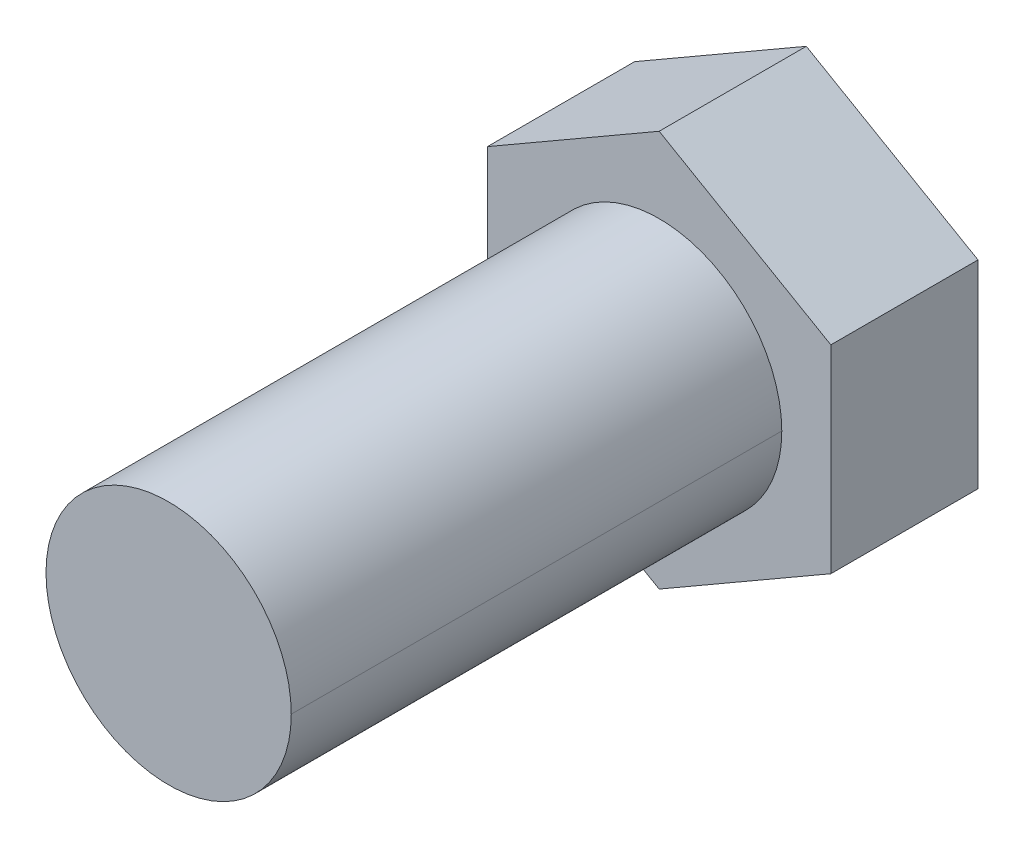
ISO-10303-21;
HEADER;
FILE_DESCRIPTION(('STEP AP214'),'2;1');
FILE_NAME('part.step','',(''),(''),'','','');
FILE_SCHEMA(('AUTOMOTIVE_DESIGN { 1 0 10303 214 1 1 1 1 }'));
ENDSEC;
DATA;
#1=APPLICATION_CONTEXT('core data for automotive mechanical design processes');
#2=APPLICATION_PROTOCOL_DEFINITION('international standard','automotive_design',2000,#1);
#3=PRODUCT_CONTEXT('',#1,'mechanical');
#4=PRODUCT('Part','Part','',(#3));
#5=PRODUCT_RELATED_PRODUCT_CATEGORY('part','',(#4));
#6=PRODUCT_DEFINITION_FORMATION('','',#4);
#7=PRODUCT_DEFINITION_CONTEXT('part definition',#1,'design');
#8=PRODUCT_DEFINITION('design','',#6,#7);
#9=PRODUCT_DEFINITION_SHAPE('','',#8);
#10=(LENGTH_UNIT() NAMED_UNIT(*) SI_UNIT(.MILLI.,.METRE.));
#11=(NAMED_UNIT(*) PLANE_ANGLE_UNIT() SI_UNIT($,.RADIAN.));
#12=(NAMED_UNIT(*) SI_UNIT($,.STERADIAN.) SOLID_ANGLE_UNIT());
#13=UNCERTAINTY_MEASURE_WITH_UNIT(LENGTH_MEASURE(1.E-05),#10,'distance_accuracy_value','');
#14=(GEOMETRIC_REPRESENTATION_CONTEXT(3) GLOBAL_UNCERTAINTY_ASSIGNED_CONTEXT((#13)) GLOBAL_UNIT_ASSIGNED_CONTEXT((#10,
#11,#12)) REPRESENTATION_CONTEXT('',''));
#15=CARTESIAN_POINT('',(0.,0.,0.));
#16=DIRECTION('',(0.,0.,1.));
#17=DIRECTION('',(1.,0.,0.));
#18=AXIS2_PLACEMENT_3D('',#15,#16,#17);
#19=CARTESIAN_POINT('',(0.,0.,15.7926861733586));
#20=DIRECTION('',(0.,0.,-1.));
#21=DIRECTION('',(1.,0.,0.));
#22=AXIS2_PLACEMENT_3D('',#19,#20,#21);
#23=CYLINDRICAL_SURFACE('',#22,1.92307692283269);
#24=DIRECTION('',(0.,0.,1.));
#25=VECTOR('',#24,1.);
#26=CARTESIAN_POINT('',(1.92307692283269,0.,15.7926861733586));
#27=LINE('',#26,#25);
#28=CARTESIAN_POINT('',(1.92307692283269,0.,11.9465323276932));
#29=VERTEX_POINT('',#28);
#30=CARTESIAN_POINT('',(1.92307692283269,0.,19.6388400190239));
#31=VERTEX_POINT('',#30);
#32=EDGE_CURVE('E74',#29,#31,#27,.T.);
#33=ORIENTED_EDGE('',*,*,#32,.F.);
#34=CARTESIAN_POINT('',(0.,0.,11.9465323276932));
#35=DIRECTION('',(0.,0.,1.));
#36=DIRECTION('',(1.,0.,0.));
#37=AXIS2_PLACEMENT_3D('',#34,#35,#36);
#38=CIRCLE('',#37,1.92307692283269);
#39=CARTESIAN_POINT('',(-1.92307692283269,0.,11.9465323276932));
#40=VERTEX_POINT('',#39);
#41=EDGE_CURVE('E11',#29,#40,#38,.T.);
#42=ORIENTED_EDGE('',*,*,#41,.T.);
#43=DIRECTION('',(0.,0.,1.));
#44=VECTOR('',#43,1.);
#45=CARTESIAN_POINT('',(-1.92307692283269,0.,15.7926861733586));
#46=LINE('',#45,#44);
#47=CARTESIAN_POINT('',(-1.92307692283269,0.,19.6388400190239));
#48=VERTEX_POINT('',#47);
#49=EDGE_CURVE('E61',#40,#48,#46,.T.);
#50=ORIENTED_EDGE('',*,*,#49,.T.);
#51=CARTESIAN_POINT('',(0.,0.,19.6388400190239));
#52=DIRECTION('',(0.,0.,1.));
#53=DIRECTION('',(1.,0.,0.));
#54=AXIS2_PLACEMENT_3D('',#51,#52,#53);
#55=CIRCLE('',#54,1.92307692283269);
#56=EDGE_CURVE('E229',#31,#48,#55,.T.);
#57=ORIENTED_EDGE('',*,*,#56,.F.);
#58=EDGE_LOOP('',(#33,#42,#50,#57));
#59=FACE_BOUND('',#58,.T.);
#60=ADVANCED_FACE('F50',(#59),#23,.T.);
#61=CARTESIAN_POINT('',(0.,0.,15.7926861733586));
#62=DIRECTION('',(0.,0.,-1.));
#63=DIRECTION('',(1.,0.,0.));
#64=AXIS2_PLACEMENT_3D('',#61,#62,#63);
#65=CYLINDRICAL_SURFACE('',#64,1.92307692283269);
#66=ORIENTED_EDGE('',*,*,#49,.F.);
#67=CARTESIAN_POINT('',(0.,0.,11.9465323276932));
#68=DIRECTION('',(0.,0.,1.));
#69=DIRECTION('',(1.,0.,0.));
#70=AXIS2_PLACEMENT_3D('',#67,#68,#69);
#71=CIRCLE('',#70,1.92307692283269);
#72=EDGE_CURVE('E165',#40,#29,#71,.T.);
#73=ORIENTED_EDGE('',*,*,#72,.T.);
#74=ORIENTED_EDGE('',*,*,#32,.T.);
#75=CARTESIAN_POINT('',(0.,0.,19.6388400190239));
#76=DIRECTION('',(0.,0.,1.));
#77=DIRECTION('',(1.,0.,0.));
#78=AXIS2_PLACEMENT_3D('',#75,#76,#77);
#79=CIRCLE('',#78,1.92307692283269);
#80=EDGE_CURVE('E226',#48,#31,#79,.T.);
#81=ORIENTED_EDGE('',*,*,#80,.F.);
#82=EDGE_LOOP('',(#66,#73,#74,#81));
#83=FACE_BOUND('',#82,.T.);
#84=ADVANCED_FACE('F277',(#83),#65,.T.);
#85=CARTESIAN_POINT('',(0.,0.,19.6388400190239));
#86=DIRECTION('',(0.,0.,1.));
#87=DIRECTION('',(1.,0.,0.));
#88=AXIS2_PLACEMENT_3D('',#85,#86,#87);
#89=PLANE('',#88);
#90=ORIENTED_EDGE('',*,*,#56,.T.);
#91=ORIENTED_EDGE('',*,*,#80,.T.);
#92=EDGE_LOOP('',(#90,#91));
#93=FACE_BOUND('',#92,.T.);
#94=ADVANCED_FACE('F272',(#93),#89,.T.);
#95=CARTESIAN_POINT('',(0.,0.,11.9465323276932));
#96=DIRECTION('',(0.,0.,1.));
#97=DIRECTION('',(1.,0.,0.));
#98=AXIS2_PLACEMENT_3D('',#95,#96,#97);
#99=PLANE('',#98);
#100=DIRECTION('',(0.,-1.,0.));
#101=VECTOR('',#100,1.);
#102=CARTESIAN_POINT('',(-2.69230769196577,0.,11.9465323276932));
#103=LINE('',#102,#101);
#104=CARTESIAN_POINT('',(-2.69230769196577,1.55440457069774,11.9465323276932));
#105=VERTEX_POINT('',#104);
#106=CARTESIAN_POINT('',(-2.69230769196577,-1.55440457069774,11.9465323276932));
#107=VERTEX_POINT('',#106);
#108=EDGE_CURVE('E222',#105,#107,#103,.T.);
#109=ORIENTED_EDGE('',*,*,#108,.T.);
#110=DIRECTION('',(0.866025403784439,-0.5,0.));
#111=VECTOR('',#110,1.);
#112=CARTESIAN_POINT('',(-1.34615384598288,-2.33160685604661,11.9465323276932));
#113=LINE('',#112,#111);
#114=CARTESIAN_POINT('',(0.,-3.10880914139547,11.9465323276932));
#115=VERTEX_POINT('',#114);
#116=EDGE_CURVE('E216',#107,#115,#113,.T.);
#117=ORIENTED_EDGE('',*,*,#116,.T.);
#118=DIRECTION('',(0.866025403784439,0.5,0.));
#119=VECTOR('',#118,1.);
#120=CARTESIAN_POINT('',(1.34615384598289,-2.33160685604661,11.9465323276932));
#121=LINE('',#120,#119);
#122=CARTESIAN_POINT('',(2.69230769196577,-1.55440457069774,11.9465323276932));
#123=VERTEX_POINT('',#122);
#124=EDGE_CURVE('E210',#115,#123,#121,.T.);
#125=ORIENTED_EDGE('',*,*,#124,.T.);
#126=DIRECTION('',(0.,1.,0.));
#127=VECTOR('',#126,1.);
#128=CARTESIAN_POINT('',(2.69230769196577,0.,11.9465323276932));
#129=LINE('',#128,#127);
#130=CARTESIAN_POINT('',(2.69230769196577,1.55440457069774,11.9465323276932));
#131=VERTEX_POINT('',#130);
#132=EDGE_CURVE('E156',#123,#131,#129,.T.);
#133=ORIENTED_EDGE('',*,*,#132,.T.);
#134=DIRECTION('',(-0.866025403784439,0.5,0.));
#135=VECTOR('',#134,1.);
#136=CARTESIAN_POINT('',(1.34615384598289,2.33160685604661,11.9465323276932));
#137=LINE('',#136,#135);
#138=CARTESIAN_POINT('',(0.,3.10880914139547,11.9465323276932));
#139=VERTEX_POINT('',#138);
#140=EDGE_CURVE('E169',#131,#139,#137,.T.);
#141=ORIENTED_EDGE('',*,*,#140,.T.);
#142=DIRECTION('',(-0.866025403784439,-0.5,0.));
#143=VECTOR('',#142,1.);
#144=CARTESIAN_POINT('',(-1.34615384598288,2.33160685604661,11.9465323276932));
#145=LINE('',#144,#143);
#146=EDGE_CURVE('E173',#139,#105,#145,.T.);
#147=ORIENTED_EDGE('',*,*,#146,.T.);
#148=EDGE_LOOP('',(#109,#117,#125,#133,#141,#147));
#149=FACE_BOUND('',#148,.T.);
#150=ORIENTED_EDGE('',*,*,#41,.F.);
#151=ORIENTED_EDGE('',*,*,#72,.F.);
#152=EDGE_LOOP('',(#150,#151));
#153=FACE_BOUND('',#152,.T.);
#154=ADVANCED_FACE('F207',(#149,#153),#99,.T.);
#155=CARTESIAN_POINT('',(0.,0.,9.63884002029393));
#156=DIRECTION('',(0.,0.,1.));
#157=DIRECTION('',(1.,0.,0.));
#158=AXIS2_PLACEMENT_3D('',#155,#156,#157);
#159=PLANE('',#158);
#160=DIRECTION('',(-0.866025403784439,-0.5,0.));
#161=VECTOR('',#160,1.);
#162=CARTESIAN_POINT('',(-1.34615384598288,2.33160685604661,9.63884002029393));
#163=LINE('',#162,#161);
#164=CARTESIAN_POINT('',(0.,3.10880914139547,9.63884002029393));
#165=VERTEX_POINT('',#164);
#166=CARTESIAN_POINT('',(-2.69230769196577,1.55440457069774,9.63884002029393));
#167=VERTEX_POINT('',#166);
#168=EDGE_CURVE('E193',#165,#167,#163,.T.);
#169=ORIENTED_EDGE('',*,*,#168,.F.);
#170=DIRECTION('',(-0.866025403784439,0.5,0.));
#171=VECTOR('',#170,1.);
#172=CARTESIAN_POINT('',(1.34615384598289,2.33160685604661,9.63884002029393));
#173=LINE('',#172,#171);
#174=CARTESIAN_POINT('',(2.69230769196577,1.55440457069774,9.63884002029393));
#175=VERTEX_POINT('',#174);
#176=EDGE_CURVE('E146',#175,#165,#173,.T.);
#177=ORIENTED_EDGE('',*,*,#176,.F.);
#178=DIRECTION('',(0.,1.,0.));
#179=VECTOR('',#178,1.);
#180=CARTESIAN_POINT('',(2.69230769196577,0.,9.63884002029393));
#181=LINE('',#180,#179);
#182=CARTESIAN_POINT('',(2.69230769196577,-1.55440457069774,9.63884002029393));
#183=VERTEX_POINT('',#182);
#184=EDGE_CURVE('E141',#183,#175,#181,.T.);
#185=ORIENTED_EDGE('',*,*,#184,.F.);
#186=DIRECTION('',(0.866025403784439,0.5,0.));
#187=VECTOR('',#186,1.);
#188=CARTESIAN_POINT('',(1.34615384598289,-2.33160685604661,9.63884002029393));
#189=LINE('',#188,#187);
#190=CARTESIAN_POINT('',(0.,-3.10880914139547,9.63884002029393));
#191=VERTEX_POINT('',#190);
#192=EDGE_CURVE('E127',#191,#183,#189,.T.);
#193=ORIENTED_EDGE('',*,*,#192,.F.);
#194=DIRECTION('',(0.866025403784439,-0.5,0.));
#195=VECTOR('',#194,1.);
#196=CARTESIAN_POINT('',(-1.34615384598288,-2.33160685604661,9.63884002029393));
#197=LINE('',#196,#195);
#198=CARTESIAN_POINT('',(-2.69230769196577,-1.55440457069774,9.63884002029393));
#199=VERTEX_POINT('',#198);
#200=EDGE_CURVE('E54',#199,#191,#197,.T.);
#201=ORIENTED_EDGE('',*,*,#200,.F.);
#202=DIRECTION('',(0.,-1.,0.));
#203=VECTOR('',#202,1.);
#204=CARTESIAN_POINT('',(-2.69230769196577,0.,9.63884002029393));
#205=LINE('',#204,#203);
#206=EDGE_CURVE('E174',#167,#199,#205,.T.);
#207=ORIENTED_EDGE('',*,*,#206,.F.);
#208=EDGE_LOOP('',(#169,#177,#185,#193,#201,#207));
#209=FACE_BOUND('',#208,.T.);
#210=ADVANCED_FACE('F144',(#209),#159,.F.);
#211=CARTESIAN_POINT('',(0.,3.10880914139547,9.63884002029393));
#212=DIRECTION('',(-0.5,0.866025403784439,0.));
#213=DIRECTION('',(-0.866025403784439,-0.5,0.));
#214=AXIS2_PLACEMENT_3D('',#211,#212,#213);
#215=PLANE('',#214);
#216=DIRECTION('',(0.,0.,1.));
#217=VECTOR('',#216,1.);
#218=CARTESIAN_POINT('',(0.,3.10880914139547,10.7926861739935));
#219=LINE('',#218,#217);
#220=EDGE_CURVE('E151',#165,#139,#219,.T.);
#221=ORIENTED_EDGE('',*,*,#220,.F.);
#222=ORIENTED_EDGE('',*,*,#168,.T.);
#223=DIRECTION('',(0.,0.,1.));
#224=VECTOR('',#223,1.);
#225=CARTESIAN_POINT('',(-2.69230769196577,1.55440457069774,10.7926861739935));
#226=LINE('',#225,#224);
#227=EDGE_CURVE('E187',#167,#105,#226,.T.);
#228=ORIENTED_EDGE('',*,*,#227,.T.);
#229=ORIENTED_EDGE('',*,*,#146,.F.);
#230=EDGE_LOOP('',(#221,#222,#228,#229));
#231=FACE_BOUND('',#230,.T.);
#232=ADVANCED_FACE('F348',(#231),#215,.T.);
#233=CARTESIAN_POINT('',(2.69230769196577,1.55440457069774,9.63884002029393));
#234=DIRECTION('',(0.5,0.866025403784439,0.));
#235=DIRECTION('',(-0.866025403784439,0.5,0.));
#236=AXIS2_PLACEMENT_3D('',#233,#234,#235);
#237=PLANE('',#236);
#238=DIRECTION('',(0.,0.,1.));
#239=VECTOR('',#238,1.);
#240=CARTESIAN_POINT('',(2.69230769196577,1.55440457069774,10.7926861739935));
#241=LINE('',#240,#239);
#242=EDGE_CURVE('E138',#175,#131,#241,.T.);
#243=ORIENTED_EDGE('',*,*,#242,.F.);
#244=ORIENTED_EDGE('',*,*,#176,.T.);
#245=ORIENTED_EDGE('',*,*,#220,.T.);
#246=ORIENTED_EDGE('',*,*,#140,.F.);
#247=EDGE_LOOP('',(#243,#244,#245,#246));
#248=FACE_BOUND('',#247,.T.);
#249=ADVANCED_FACE('F203',(#248),#237,.T.);
#250=CARTESIAN_POINT('',(2.69230769196577,-1.55440457069774,9.63884002029393));
#251=DIRECTION('',(1.,0.,0.));
#252=DIRECTION('',(0.,1.,0.));
#253=AXIS2_PLACEMENT_3D('',#250,#251,#252);
#254=PLANE('',#253);
#255=DIRECTION('',(0.,0.,1.));
#256=VECTOR('',#255,1.);
#257=CARTESIAN_POINT('',(2.69230769196577,-1.55440457069774,10.7926861739935));
#258=LINE('',#257,#256);
#259=EDGE_CURVE('E132',#183,#123,#258,.T.);
#260=ORIENTED_EDGE('',*,*,#259,.F.);
#261=ORIENTED_EDGE('',*,*,#184,.T.);
#262=ORIENTED_EDGE('',*,*,#242,.T.);
#263=ORIENTED_EDGE('',*,*,#132,.F.);
#264=EDGE_LOOP('',(#260,#261,#262,#263));
#265=FACE_BOUND('',#264,.T.);
#266=ADVANCED_FACE('F154',(#265),#254,.T.);
#267=CARTESIAN_POINT('',(0.,-3.10880914139547,9.63884002029393));
#268=DIRECTION('',(0.5,-0.866025403784439,0.));
#269=DIRECTION('',(0.866025403784439,0.5,0.));
#270=AXIS2_PLACEMENT_3D('',#267,#268,#269);
#271=PLANE('',#270);
#272=DIRECTION('',(0.,0.,1.));
#273=VECTOR('',#272,1.);
#274=CARTESIAN_POINT('',(0.,-3.10880914139547,10.7926861739935));
#275=LINE('',#274,#273);
#276=EDGE_CURVE('E134',#191,#115,#275,.T.);
#277=ORIENTED_EDGE('',*,*,#276,.F.);
#278=ORIENTED_EDGE('',*,*,#192,.T.);
#279=ORIENTED_EDGE('',*,*,#259,.T.);
#280=ORIENTED_EDGE('',*,*,#124,.F.);
#281=EDGE_LOOP('',(#277,#278,#279,#280));
#282=FACE_BOUND('',#281,.T.);
#283=ADVANCED_FACE('F52',(#282),#271,.T.);
#284=CARTESIAN_POINT('',(-2.69230769196577,-1.55440457069774,9.63884002029393));
#285=DIRECTION('',(-0.5,-0.866025403784439,0.));
#286=DIRECTION('',(0.866025403784439,-0.5,0.));
#287=AXIS2_PLACEMENT_3D('',#284,#285,#286);
#288=PLANE('',#287);
#289=DIRECTION('',(0.,0.,1.));
#290=VECTOR('',#289,1.);
#291=CARTESIAN_POINT('',(-2.69230769196577,-1.55440457069774,10.7926861739935));
#292=LINE('',#291,#290);
#293=EDGE_CURVE('E176',#199,#107,#292,.T.);
#294=ORIENTED_EDGE('',*,*,#293,.F.);
#295=ORIENTED_EDGE('',*,*,#200,.T.);
#296=ORIENTED_EDGE('',*,*,#276,.T.);
#297=ORIENTED_EDGE('',*,*,#116,.F.);
#298=EDGE_LOOP('',(#294,#295,#296,#297));
#299=FACE_BOUND('',#298,.T.);
#300=ADVANCED_FACE('F246',(#299),#288,.T.);
#301=CARTESIAN_POINT('',(-2.69230769196577,1.55440457069774,9.63884002029393));
#302=DIRECTION('',(-1.,0.,0.));
#303=DIRECTION('',(0.,-1.,0.));
#304=AXIS2_PLACEMENT_3D('',#301,#302,#303);
#305=PLANE('',#304);
#306=ORIENTED_EDGE('',*,*,#227,.F.);
#307=ORIENTED_EDGE('',*,*,#206,.T.);
#308=ORIENTED_EDGE('',*,*,#293,.T.);
#309=ORIENTED_EDGE('',*,*,#108,.F.);
#310=EDGE_LOOP('',(#306,#307,#308,#309));
#311=FACE_BOUND('',#310,.T.);
#312=ADVANCED_FACE('F243',(#311),#305,.T.);
#313=CLOSED_SHELL('',(#60,#84,#94,#154,#210,#232,#249,#266,#283,#300,#312));
#314=MANIFOLD_SOLID_BREP('B2',#313);
#315=ADVANCED_BREP_SHAPE_REPRESENTATION('',(#18,#314),#14);
#316=SHAPE_DEFINITION_REPRESENTATION(#9,#315);
ENDSEC;
END-ISO-10303-21;
